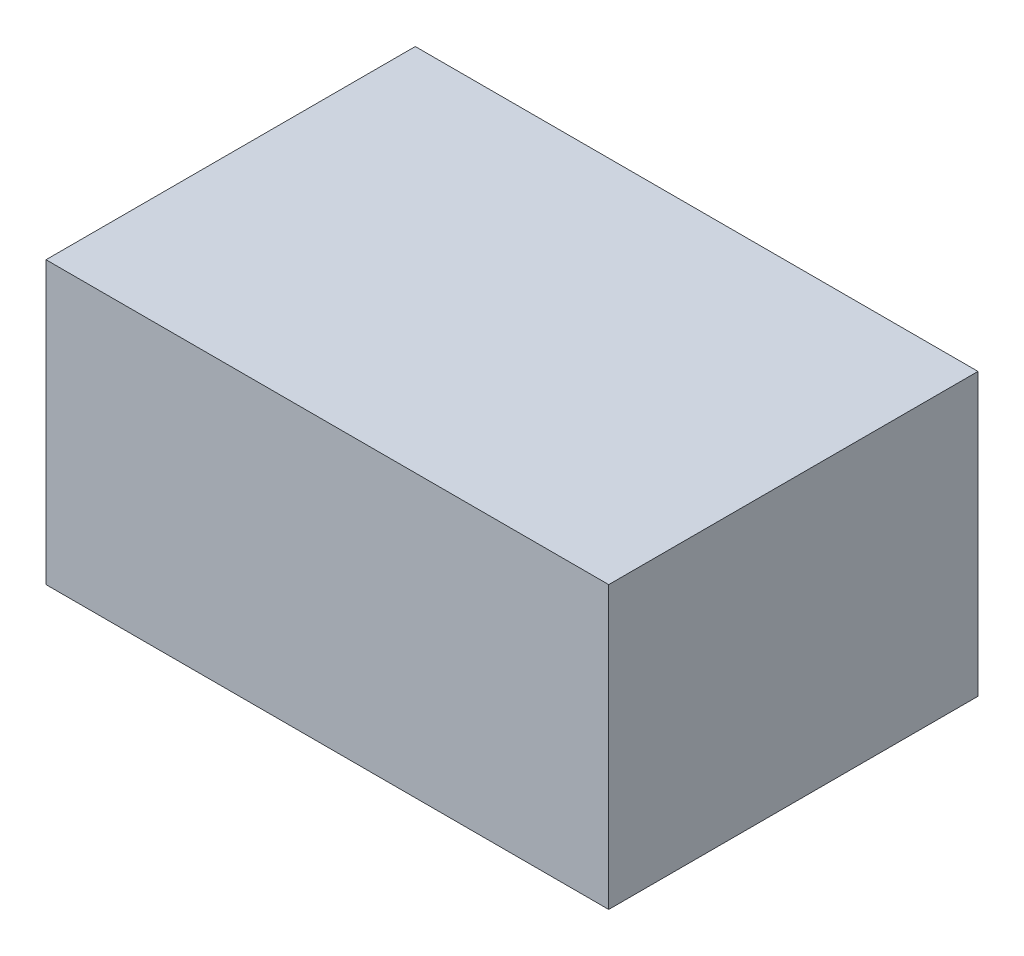
ISO-10303-21;
HEADER;
FILE_DESCRIPTION(('STEP AP214'),'2;1');
FILE_NAME('part.step','',(''),(''),'','','');
FILE_SCHEMA(('AUTOMOTIVE_DESIGN { 1 0 10303 214 1 1 1 1 }'));
ENDSEC;
DATA;
#1=APPLICATION_CONTEXT('core data for automotive mechanical design processes');
#2=APPLICATION_PROTOCOL_DEFINITION('international standard','automotive_design',2000,#1);
#3=PRODUCT_CONTEXT('',#1,'mechanical');
#4=PRODUCT('Part','Part','',(#3));
#5=PRODUCT_RELATED_PRODUCT_CATEGORY('part','',(#4));
#6=PRODUCT_DEFINITION_FORMATION('','',#4);
#7=PRODUCT_DEFINITION_CONTEXT('part definition',#1,'design');
#8=PRODUCT_DEFINITION('design','',#6,#7);
#9=PRODUCT_DEFINITION_SHAPE('','',#8);
#10=(LENGTH_UNIT() NAMED_UNIT(*) SI_UNIT(.MILLI.,.METRE.));
#11=(NAMED_UNIT(*) PLANE_ANGLE_UNIT() SI_UNIT($,.RADIAN.));
#12=(NAMED_UNIT(*) SI_UNIT($,.STERADIAN.) SOLID_ANGLE_UNIT());
#13=UNCERTAINTY_MEASURE_WITH_UNIT(LENGTH_MEASURE(1.E-05),#10,'distance_accuracy_value','');
#14=(GEOMETRIC_REPRESENTATION_CONTEXT(3) GLOBAL_UNCERTAINTY_ASSIGNED_CONTEXT((#13)) GLOBAL_UNIT_ASSIGNED_CONTEXT((#10,
#11,#12)) REPRESENTATION_CONTEXT('',''));
#15=CARTESIAN_POINT('',(0.,0.,0.));
#16=DIRECTION('',(0.,0.,1.));
#17=DIRECTION('',(1.,0.,0.));
#18=AXIS2_PLACEMENT_3D('',#15,#16,#17);
#19=CARTESIAN_POINT('',(101.6,101.6,66.675));
#20=DIRECTION('',(-1.,0.,0.));
#21=DIRECTION('',(0.,0.,1.));
#22=AXIS2_PLACEMENT_3D('',#19,#20,#21);
#23=PLANE('',#22);
#24=DIRECTION('',(0.,0.,-1.));
#25=VECTOR('',#24,1.);
#26=CARTESIAN_POINT('',(101.6,0.,66.675));
#27=LINE('',#26,#25);
#28=CARTESIAN_POINT('',(101.6,0.,66.675));
#29=VERTEX_POINT('',#28);
#30=CARTESIAN_POINT('',(101.6,0.,-66.675));
#31=VERTEX_POINT('',#30);
#32=EDGE_CURVE('E95',#29,#31,#27,.T.);
#33=ORIENTED_EDGE('',*,*,#32,.T.);
#34=DIRECTION('',(0.,-1.,0.));
#35=VECTOR('',#34,1.);
#36=CARTESIAN_POINT('',(101.6,101.6,-66.675));
#37=LINE('',#36,#35);
#38=CARTESIAN_POINT('',(101.6,101.6,-66.675));
#39=VERTEX_POINT('',#38);
#40=EDGE_CURVE('E11',#39,#31,#37,.T.);
#41=ORIENTED_EDGE('',*,*,#40,.F.);
#42=DIRECTION('',(0.,0.,-1.));
#43=VECTOR('',#42,1.);
#44=CARTESIAN_POINT('',(101.6,101.6,66.675));
#45=LINE('',#44,#43);
#46=CARTESIAN_POINT('',(101.6,101.6,66.675));
#47=VERTEX_POINT('',#46);
#48=EDGE_CURVE('E83',#47,#39,#45,.T.);
#49=ORIENTED_EDGE('',*,*,#48,.F.);
#50=DIRECTION('',(0.,-1.,0.));
#51=VECTOR('',#50,1.);
#52=CARTESIAN_POINT('',(101.6,101.6,66.675));
#53=LINE('',#52,#51);
#54=EDGE_CURVE('E91',#47,#29,#53,.T.);
#55=ORIENTED_EDGE('',*,*,#54,.T.);
#56=EDGE_LOOP('',(#33,#41,#49,#55));
#57=FACE_BOUND('',#56,.T.);
#58=ADVANCED_FACE('F32',(#57),#23,.F.);
#59=CARTESIAN_POINT('',(-101.6,101.6,-66.675));
#60=DIRECTION('',(0.,0.,1.));
#61=DIRECTION('',(1.,0.,0.));
#62=AXIS2_PLACEMENT_3D('',#59,#60,#61);
#63=PLANE('',#62);
#64=DIRECTION('',(-1.,0.,0.));
#65=VECTOR('',#64,1.);
#66=CARTESIAN_POINT('',(-101.6,0.,-66.675));
#67=LINE('',#66,#65);
#68=CARTESIAN_POINT('',(-101.6,0.,-66.675));
#69=VERTEX_POINT('',#68);
#70=EDGE_CURVE('E87',#31,#69,#67,.T.);
#71=ORIENTED_EDGE('',*,*,#70,.T.);
#72=DIRECTION('',(0.,-1.,0.));
#73=VECTOR('',#72,1.);
#74=CARTESIAN_POINT('',(-101.6,101.6,-66.675));
#75=LINE('',#74,#73);
#76=CARTESIAN_POINT('',(-101.6,101.6,-66.675));
#77=VERTEX_POINT('',#76);
#78=EDGE_CURVE('E40',#77,#69,#75,.T.);
#79=ORIENTED_EDGE('',*,*,#78,.F.);
#80=DIRECTION('',(-1.,0.,0.));
#81=VECTOR('',#80,1.);
#82=CARTESIAN_POINT('',(-101.6,101.6,-66.675));
#83=LINE('',#82,#81);
#84=EDGE_CURVE('E78',#39,#77,#83,.T.);
#85=ORIENTED_EDGE('',*,*,#84,.F.);
#86=ORIENTED_EDGE('',*,*,#40,.T.);
#87=EDGE_LOOP('',(#71,#79,#85,#86));
#88=FACE_BOUND('',#87,.T.);
#89=ADVANCED_FACE('F86',(#88),#63,.F.);
#90=CARTESIAN_POINT('',(-101.6,101.6,66.675));
#91=DIRECTION('',(1.,0.,0.));
#92=DIRECTION('',(0.,0.,-1.));
#93=AXIS2_PLACEMENT_3D('',#90,#91,#92);
#94=PLANE('',#93);
#95=DIRECTION('',(0.,0.,1.));
#96=VECTOR('',#95,1.);
#97=CARTESIAN_POINT('',(-101.6,0.,66.675));
#98=LINE('',#97,#96);
#99=CARTESIAN_POINT('',(-101.6,0.,66.675));
#100=VERTEX_POINT('',#99);
#101=EDGE_CURVE('E65',#69,#100,#98,.T.);
#102=ORIENTED_EDGE('',*,*,#101,.T.);
#103=DIRECTION('',(0.,-1.,0.));
#104=VECTOR('',#103,1.);
#105=CARTESIAN_POINT('',(-101.6,101.6,66.675));
#106=LINE('',#105,#104);
#107=CARTESIAN_POINT('',(-101.6,101.6,66.675));
#108=VERTEX_POINT('',#107);
#109=EDGE_CURVE('E88',#108,#100,#106,.T.);
#110=ORIENTED_EDGE('',*,*,#109,.F.);
#111=DIRECTION('',(0.,0.,1.));
#112=VECTOR('',#111,1.);
#113=CARTESIAN_POINT('',(-101.6,101.6,66.675));
#114=LINE('',#113,#112);
#115=EDGE_CURVE('E81',#77,#108,#114,.T.);
#116=ORIENTED_EDGE('',*,*,#115,.F.);
#117=ORIENTED_EDGE('',*,*,#78,.T.);
#118=EDGE_LOOP('',(#102,#110,#116,#117));
#119=FACE_BOUND('',#118,.T.);
#120=ADVANCED_FACE('F89',(#119),#94,.F.);
#121=CARTESIAN_POINT('',(-101.6,101.6,66.675));
#122=DIRECTION('',(0.,0.,-1.));
#123=DIRECTION('',(-1.,0.,0.));
#124=AXIS2_PLACEMENT_3D('',#121,#122,#123);
#125=PLANE('',#124);
#126=DIRECTION('',(1.,0.,0.));
#127=VECTOR('',#126,1.);
#128=CARTESIAN_POINT('',(-101.6,0.,66.675));
#129=LINE('',#128,#127);
#130=EDGE_CURVE('E71',#100,#29,#129,.T.);
#131=ORIENTED_EDGE('',*,*,#130,.T.);
#132=ORIENTED_EDGE('',*,*,#54,.F.);
#133=DIRECTION('',(1.,0.,0.));
#134=VECTOR('',#133,1.);
#135=CARTESIAN_POINT('',(-101.6,101.6,66.675));
#136=LINE('',#135,#134);
#137=EDGE_CURVE('E48',#108,#47,#136,.T.);
#138=ORIENTED_EDGE('',*,*,#137,.F.);
#139=ORIENTED_EDGE('',*,*,#109,.T.);
#140=EDGE_LOOP('',(#131,#132,#138,#139));
#141=FACE_BOUND('',#140,.T.);
#142=ADVANCED_FACE('F102',(#141),#125,.F.);
#143=CARTESIAN_POINT('',(0.,101.6,0.));
#144=DIRECTION('',(0.,-1.,0.));
#145=DIRECTION('',(0.,0.,-1.));
#146=AXIS2_PLACEMENT_3D('',#143,#144,#145);
#147=PLANE('',#146);
#148=ORIENTED_EDGE('',*,*,#48,.T.);
#149=ORIENTED_EDGE('',*,*,#84,.T.);
#150=ORIENTED_EDGE('',*,*,#115,.T.);
#151=ORIENTED_EDGE('',*,*,#137,.T.);
#152=EDGE_LOOP('',(#148,#149,#150,#151));
#153=FACE_BOUND('',#152,.T.);
#154=ADVANCED_FACE('F79',(#153),#147,.F.);
#155=CARTESIAN_POINT('',(0.,0.,0.));
#156=DIRECTION('',(0.,-1.,0.));
#157=DIRECTION('',(0.,0.,-1.));
#158=AXIS2_PLACEMENT_3D('',#155,#156,#157);
#159=PLANE('',#158);
#160=ORIENTED_EDGE('',*,*,#32,.F.);
#161=ORIENTED_EDGE('',*,*,#130,.F.);
#162=ORIENTED_EDGE('',*,*,#101,.F.);
#163=ORIENTED_EDGE('',*,*,#70,.F.);
#164=EDGE_LOOP('',(#160,#161,#162,#163));
#165=FACE_BOUND('',#164,.T.);
#166=ADVANCED_FACE('F105',(#165),#159,.T.);
#167=CLOSED_SHELL('',(#58,#89,#120,#142,#154,#166));
#168=MANIFOLD_SOLID_BREP('B2',#167);
#169=ADVANCED_BREP_SHAPE_REPRESENTATION('',(#18,#168),#14);
#170=SHAPE_DEFINITION_REPRESENTATION(#9,#169);
ENDSEC;
END-ISO-10303-21;
